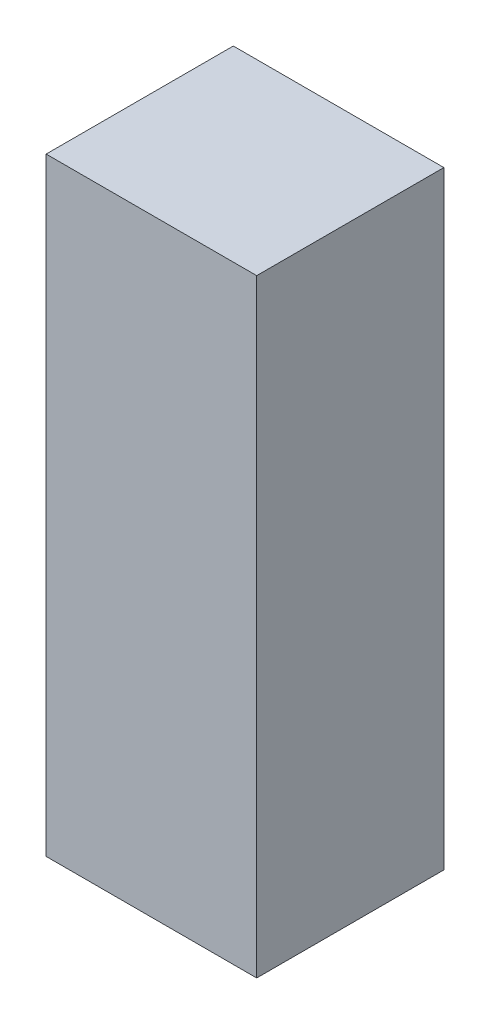
ISO-10303-21;
HEADER;
FILE_DESCRIPTION(('STEP AP214'),'2;1');
FILE_NAME('part.step','',(''),(''),'','','');
FILE_SCHEMA(('AUTOMOTIVE_DESIGN { 1 0 10303 214 1 1 1 1 }'));
ENDSEC;
DATA;
#1=APPLICATION_CONTEXT('core data for automotive mechanical design processes');
#2=APPLICATION_PROTOCOL_DEFINITION('international standard','automotive_design',2000,#1);
#3=PRODUCT_CONTEXT('',#1,'mechanical');
#4=PRODUCT('Part','Part','',(#3));
#5=PRODUCT_RELATED_PRODUCT_CATEGORY('part','',(#4));
#6=PRODUCT_DEFINITION_FORMATION('','',#4);
#7=PRODUCT_DEFINITION_CONTEXT('part definition',#1,'design');
#8=PRODUCT_DEFINITION('design','',#6,#7);
#9=PRODUCT_DEFINITION_SHAPE('','',#8);
#10=(LENGTH_UNIT() NAMED_UNIT(*) SI_UNIT(.MILLI.,.METRE.));
#11=(NAMED_UNIT(*) PLANE_ANGLE_UNIT() SI_UNIT($,.RADIAN.));
#12=(NAMED_UNIT(*) SI_UNIT($,.STERADIAN.) SOLID_ANGLE_UNIT());
#13=UNCERTAINTY_MEASURE_WITH_UNIT(LENGTH_MEASURE(1.E-05),#10,'distance_accuracy_value','');
#14=(GEOMETRIC_REPRESENTATION_CONTEXT(3) GLOBAL_UNCERTAINTY_ASSIGNED_CONTEXT((#13)) GLOBAL_UNIT_ASSIGNED_CONTEXT((#10,
#11,#12)) REPRESENTATION_CONTEXT('',''));
#15=CARTESIAN_POINT('',(0.,0.,0.));
#16=DIRECTION('',(0.,0.,1.));
#17=DIRECTION('',(1.,0.,0.));
#18=AXIS2_PLACEMENT_3D('',#15,#16,#17);
#19=CARTESIAN_POINT('',(0.22500082,0.65000124,0.4));
#20=DIRECTION('',(0.,0.,1.));
#21=DIRECTION('',(1.,0.,0.));
#22=AXIS2_PLACEMENT_3D('',#19,#20,#21);
#23=PLANE('',#22);
#24=DIRECTION('',(1.,0.,0.));
#25=VECTOR('',#24,1.);
#26=CARTESIAN_POINT('',(0.22500082,-0.6499987,0.4));
#27=LINE('',#26,#25);
#28=CARTESIAN_POINT('',(0.22500082,-0.6499987,0.4));
#29=VERTEX_POINT('',#28);
#30=CARTESIAN_POINT('',(-0.22499828,-0.6499987,0.4));
#31=VERTEX_POINT('',#30);
#32=EDGE_CURVE('E52',#29,#31,#27,.F.);
#33=ORIENTED_EDGE('',*,*,#32,.F.);
#34=DIRECTION('',(0.,1.,0.));
#35=VECTOR('',#34,1.);
#36=CARTESIAN_POINT('',(0.22500082,0.65000124,0.4));
#37=LINE('',#36,#35);
#38=CARTESIAN_POINT('',(0.22500082,0.65000124,0.4));
#39=VERTEX_POINT('',#38);
#40=EDGE_CURVE('E67',#39,#29,#37,.F.);
#41=ORIENTED_EDGE('',*,*,#40,.F.);
#42=DIRECTION('',(1.,0.,0.));
#43=VECTOR('',#42,1.);
#44=CARTESIAN_POINT('',(-0.22499828,0.65000124,0.4));
#45=LINE('',#44,#43);
#46=CARTESIAN_POINT('',(-0.22499828,0.65000124,0.4));
#47=VERTEX_POINT('',#46);
#48=EDGE_CURVE('E19',#47,#39,#45,.T.);
#49=ORIENTED_EDGE('',*,*,#48,.F.);
#50=DIRECTION('',(0.,1.,0.));
#51=VECTOR('',#50,1.);
#52=CARTESIAN_POINT('',(-0.22499828,-0.6499987,0.4));
#53=LINE('',#52,#51);
#54=EDGE_CURVE('E57',#31,#47,#53,.T.);
#55=ORIENTED_EDGE('',*,*,#54,.F.);
#56=EDGE_LOOP('',(#33,#41,#49,#55));
#57=FACE_BOUND('',#56,.T.);
#58=ADVANCED_FACE('F16',(#57),#23,.T.);
#59=CARTESIAN_POINT('',(-0.22499828,0.65000124,0.));
#60=DIRECTION('',(0.,1.,0.));
#61=DIRECTION('',(0.,0.,1.));
#62=AXIS2_PLACEMENT_3D('',#59,#60,#61);
#63=PLANE('',#62);
#64=DIRECTION('',(0.,0.,-1.));
#65=VECTOR('',#64,1.);
#66=CARTESIAN_POINT('',(0.22500082,0.65000124,0.));
#67=LINE('',#66,#65);
#68=CARTESIAN_POINT('',(0.22500082,0.65000124,0.));
#69=VERTEX_POINT('',#68);
#70=EDGE_CURVE('E78',#69,#39,#67,.F.);
#71=ORIENTED_EDGE('',*,*,#70,.F.);
#72=DIRECTION('',(1.,0.,0.));
#73=VECTOR('',#72,1.);
#74=CARTESIAN_POINT('',(0.22500082,0.65000124,0.));
#75=LINE('',#74,#73);
#76=CARTESIAN_POINT('',(-0.22499828,0.65000124,0.));
#77=VERTEX_POINT('',#76);
#78=EDGE_CURVE('E73',#69,#77,#75,.F.);
#79=ORIENTED_EDGE('',*,*,#78,.T.);
#80=DIRECTION('',(0.,0.,1.));
#81=VECTOR('',#80,1.);
#82=CARTESIAN_POINT('',(-0.22499828,0.65000124,0.));
#83=LINE('',#82,#81);
#84=EDGE_CURVE('E62',#47,#77,#83,.F.);
#85=ORIENTED_EDGE('',*,*,#84,.F.);
#86=ORIENTED_EDGE('',*,*,#48,.T.);
#87=EDGE_LOOP('',(#71,#79,#85,#86));
#88=FACE_BOUND('',#87,.T.);
#89=ADVANCED_FACE('F72',(#88),#63,.T.);
#90=CARTESIAN_POINT('',(-0.22499828,-0.6499987,0.));
#91=DIRECTION('',(-1.,0.,0.));
#92=DIRECTION('',(0.,0.,1.));
#93=AXIS2_PLACEMENT_3D('',#90,#91,#92);
#94=PLANE('',#93);
#95=ORIENTED_EDGE('',*,*,#84,.T.);
#96=DIRECTION('',(0.,1.,0.));
#97=VECTOR('',#96,1.);
#98=CARTESIAN_POINT('',(-0.22499828,0.65000124,0.));
#99=LINE('',#98,#97);
#100=CARTESIAN_POINT('',(-0.22499828,-0.6499987,0.));
#101=VERTEX_POINT('',#100);
#102=EDGE_CURVE('E83',#77,#101,#99,.F.);
#103=ORIENTED_EDGE('',*,*,#102,.T.);
#104=DIRECTION('',(0.,0.,-1.));
#105=VECTOR('',#104,1.);
#106=CARTESIAN_POINT('',(-0.22499828,-0.6499987,0.));
#107=LINE('',#106,#105);
#108=EDGE_CURVE('E64',#31,#101,#107,.T.);
#109=ORIENTED_EDGE('',*,*,#108,.F.);
#110=ORIENTED_EDGE('',*,*,#54,.T.);
#111=EDGE_LOOP('',(#95,#103,#109,#110));
#112=FACE_BOUND('',#111,.T.);
#113=ADVANCED_FACE('F59',(#112),#94,.T.);
#114=CARTESIAN_POINT('',(0.22500082,-0.6499987,0.));
#115=DIRECTION('',(0.,-1.,0.));
#116=DIRECTION('',(0.,0.,-1.));
#117=AXIS2_PLACEMENT_3D('',#114,#115,#116);
#118=PLANE('',#117);
#119=ORIENTED_EDGE('',*,*,#108,.T.);
#120=DIRECTION('',(1.,0.,0.));
#121=VECTOR('',#120,1.);
#122=CARTESIAN_POINT('',(0.22500082,-0.6499987,0.));
#123=LINE('',#122,#121);
#124=CARTESIAN_POINT('',(0.22500082,-0.6499987,0.));
#125=VERTEX_POINT('',#124);
#126=EDGE_CURVE('E25',#101,#125,#123,.T.);
#127=ORIENTED_EDGE('',*,*,#126,.T.);
#128=DIRECTION('',(0.,0.,-1.));
#129=VECTOR('',#128,1.);
#130=CARTESIAN_POINT('',(0.22500082,-0.6499987,0.));
#131=LINE('',#130,#129);
#132=EDGE_CURVE('E33',#29,#125,#131,.T.);
#133=ORIENTED_EDGE('',*,*,#132,.F.);
#134=ORIENTED_EDGE('',*,*,#32,.T.);
#135=EDGE_LOOP('',(#119,#127,#133,#134));
#136=FACE_BOUND('',#135,.T.);
#137=ADVANCED_FACE('F87',(#136),#118,.T.);
#138=CARTESIAN_POINT('',(0.22500082,0.65000124,0.));
#139=DIRECTION('',(1.,0.,0.));
#140=DIRECTION('',(0.,0.,-1.));
#141=AXIS2_PLACEMENT_3D('',#138,#139,#140);
#142=PLANE('',#141);
#143=ORIENTED_EDGE('',*,*,#132,.T.);
#144=DIRECTION('',(0.,1.,0.));
#145=VECTOR('',#144,1.);
#146=CARTESIAN_POINT('',(0.22500082,0.65000124,0.));
#147=LINE('',#146,#145);
#148=EDGE_CURVE('E11',#125,#69,#147,.T.);
#149=ORIENTED_EDGE('',*,*,#148,.T.);
#150=ORIENTED_EDGE('',*,*,#70,.T.);
#151=ORIENTED_EDGE('',*,*,#40,.T.);
#152=EDGE_LOOP('',(#143,#149,#150,#151));
#153=FACE_BOUND('',#152,.T.);
#154=ADVANCED_FACE('F90',(#153),#142,.T.);
#155=CARTESIAN_POINT('',(0.22500082,0.65000124,0.));
#156=DIRECTION('',(0.,0.,1.));
#157=DIRECTION('',(1.,0.,0.));
#158=AXIS2_PLACEMENT_3D('',#155,#156,#157);
#159=PLANE('',#158);
#160=ORIENTED_EDGE('',*,*,#126,.F.);
#161=ORIENTED_EDGE('',*,*,#102,.F.);
#162=ORIENTED_EDGE('',*,*,#78,.F.);
#163=ORIENTED_EDGE('',*,*,#148,.F.);
#164=EDGE_LOOP('',(#160,#161,#162,#163));
#165=FACE_BOUND('',#164,.T.);
#166=ADVANCED_FACE('F89',(#165),#159,.F.);
#167=CLOSED_SHELL('',(#58,#89,#113,#137,#154,#166));
#168=MANIFOLD_SOLID_BREP('B1',#167);
#169=ADVANCED_BREP_SHAPE_REPRESENTATION('',(#18,#168),#14);
#170=SHAPE_DEFINITION_REPRESENTATION(#9,#169);
ENDSEC;
END-ISO-10303-21;
